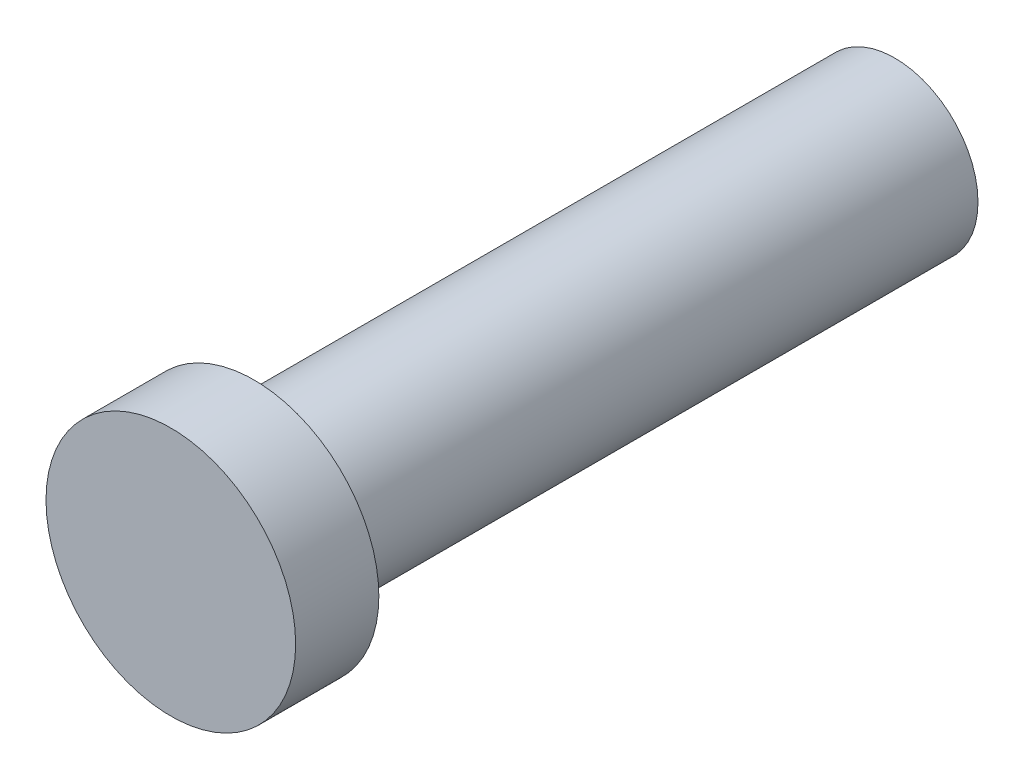
ISO-10303-21;
HEADER;
FILE_DESCRIPTION(('STEP AP214'),'2;1');
FILE_NAME('part.step','',(''),(''),'','','');
FILE_SCHEMA(('AUTOMOTIVE_DESIGN { 1 0 10303 214 1 1 1 1 }'));
ENDSEC;
DATA;
#1=APPLICATION_CONTEXT('core data for automotive mechanical design processes');
#2=APPLICATION_PROTOCOL_DEFINITION('international standard','automotive_design',2000,#1);
#3=PRODUCT_CONTEXT('',#1,'mechanical');
#4=PRODUCT('Part','Part','',(#3));
#5=PRODUCT_RELATED_PRODUCT_CATEGORY('part','',(#4));
#6=PRODUCT_DEFINITION_FORMATION('','',#4);
#7=PRODUCT_DEFINITION_CONTEXT('part definition',#1,'design');
#8=PRODUCT_DEFINITION('design','',#6,#7);
#9=PRODUCT_DEFINITION_SHAPE('','',#8);
#10=(LENGTH_UNIT() NAMED_UNIT(*) SI_UNIT(.MILLI.,.METRE.));
#11=(NAMED_UNIT(*) PLANE_ANGLE_UNIT() SI_UNIT($,.RADIAN.));
#12=(NAMED_UNIT(*) SI_UNIT($,.STERADIAN.) SOLID_ANGLE_UNIT());
#13=UNCERTAINTY_MEASURE_WITH_UNIT(LENGTH_MEASURE(1.E-05),#10,'distance_accuracy_value','');
#14=(GEOMETRIC_REPRESENTATION_CONTEXT(3) GLOBAL_UNCERTAINTY_ASSIGNED_CONTEXT((#13)) GLOBAL_UNIT_ASSIGNED_CONTEXT((#10,
#11,#12)) REPRESENTATION_CONTEXT('',''));
#15=CARTESIAN_POINT('',(0.,0.,0.));
#16=DIRECTION('',(0.,0.,1.));
#17=DIRECTION('',(1.,0.,0.));
#18=AXIS2_PLACEMENT_3D('',#15,#16,#17);
#19=CARTESIAN_POINT('',(0.,0.,7.7));
#20=DIRECTION('',(0.,0.,-1.));
#21=DIRECTION('',(-1.,0.,0.));
#22=AXIS2_PLACEMENT_3D('',#19,#20,#21);
#23=CYLINDRICAL_SURFACE('',#22,1.);
#24=CARTESIAN_POINT('',(0.,0.,7.7));
#25=DIRECTION('',(0.,0.,1.));
#26=DIRECTION('',(1.,0.,0.));
#27=AXIS2_PLACEMENT_3D('',#24,#25,#26);
#28=CIRCLE('',#27,1.);
#29=CARTESIAN_POINT('',(1.,0.,7.7));
#30=VERTEX_POINT('',#29);
#31=EDGE_CURVE('E10',#30,#30,#28,.T.);
#32=ORIENTED_EDGE('',*,*,#31,.F.);
#33=EDGE_LOOP('',(#32));
#34=FACE_BOUND('',#33,.T.);
#35=CARTESIAN_POINT('',(0.,0.,0.));
#36=DIRECTION('',(0.,0.,1.));
#37=DIRECTION('',(1.,0.,0.));
#38=AXIS2_PLACEMENT_3D('',#35,#36,#37);
#39=CIRCLE('',#38,1.);
#40=CARTESIAN_POINT('',(1.,0.,0.));
#41=VERTEX_POINT('',#40);
#42=EDGE_CURVE('E33',#41,#41,#39,.T.);
#43=ORIENTED_EDGE('',*,*,#42,.T.);
#44=EDGE_LOOP('',(#43));
#45=FACE_BOUND('',#44,.T.);
#46=ADVANCED_FACE('F30',(#34,#45),#23,.T.);
#47=CARTESIAN_POINT('',(0.,0.,0.));
#48=DIRECTION('',(0.,0.,1.));
#49=DIRECTION('',(1.,0.,0.));
#50=AXIS2_PLACEMENT_3D('',#47,#48,#49);
#51=PLANE('',#50);
#52=ORIENTED_EDGE('',*,*,#42,.F.);
#53=EDGE_LOOP('',(#52));
#54=FACE_BOUND('',#53,.T.);
#55=ADVANCED_FACE('F53',(#54),#51,.F.);
#56=CARTESIAN_POINT('',(0.,0.,8.7));
#57=DIRECTION('',(0.,0.,-1.));
#58=DIRECTION('',(-1.,0.,0.));
#59=AXIS2_PLACEMENT_3D('',#56,#57,#58);
#60=CYLINDRICAL_SURFACE('',#59,1.5);
#61=CARTESIAN_POINT('',(0.,0.,8.7));
#62=DIRECTION('',(0.,0.,1.));
#63=DIRECTION('',(1.,0.,0.));
#64=AXIS2_PLACEMENT_3D('',#61,#62,#63);
#65=CIRCLE('',#64,1.5);
#66=CARTESIAN_POINT('',(1.5,0.,8.7));
#67=VERTEX_POINT('',#66);
#68=EDGE_CURVE('E40',#67,#67,#65,.T.);
#69=ORIENTED_EDGE('',*,*,#68,.F.);
#70=EDGE_LOOP('',(#69));
#71=FACE_BOUND('',#70,.T.);
#72=CARTESIAN_POINT('',(0.,0.,7.7));
#73=DIRECTION('',(0.,0.,1.));
#74=DIRECTION('',(1.,0.,0.));
#75=AXIS2_PLACEMENT_3D('',#72,#73,#74);
#76=CIRCLE('',#75,1.5);
#77=CARTESIAN_POINT('',(1.5,0.,7.7));
#78=VERTEX_POINT('',#77);
#79=EDGE_CURVE('E42',#78,#78,#76,.T.);
#80=ORIENTED_EDGE('',*,*,#79,.T.);
#81=EDGE_LOOP('',(#80));
#82=FACE_BOUND('',#81,.T.);
#83=ADVANCED_FACE('F50',(#71,#82),#60,.T.);
#84=CARTESIAN_POINT('',(0.,0.,8.7));
#85=DIRECTION('',(0.,0.,1.));
#86=DIRECTION('',(1.,0.,0.));
#87=AXIS2_PLACEMENT_3D('',#84,#85,#86);
#88=PLANE('',#87);
#89=ORIENTED_EDGE('',*,*,#68,.T.);
#90=EDGE_LOOP('',(#89));
#91=FACE_BOUND('',#90,.T.);
#92=ADVANCED_FACE('F48',(#91),#88,.T.);
#93=CARTESIAN_POINT('',(0.,0.,7.7));
#94=DIRECTION('',(0.,0.,1.));
#95=DIRECTION('',(1.,0.,0.));
#96=AXIS2_PLACEMENT_3D('',#93,#94,#95);
#97=PLANE('',#96);
#98=ORIENTED_EDGE('',*,*,#31,.T.);
#99=EDGE_LOOP('',(#98));
#100=FACE_BOUND('',#99,.T.);
#101=ORIENTED_EDGE('',*,*,#79,.F.);
#102=EDGE_LOOP('',(#101));
#103=FACE_BOUND('',#102,.T.);
#104=ADVANCED_FACE('F57',(#100,#103),#97,.F.);
#105=CLOSED_SHELL('',(#46,#55,#83,#92,#104));
#106=MANIFOLD_SOLID_BREP('B2',#105);
#107=ADVANCED_BREP_SHAPE_REPRESENTATION('',(#18,#106),#14);
#108=SHAPE_DEFINITION_REPRESENTATION(#9,#107);
ENDSEC;
END-ISO-10303-21;
